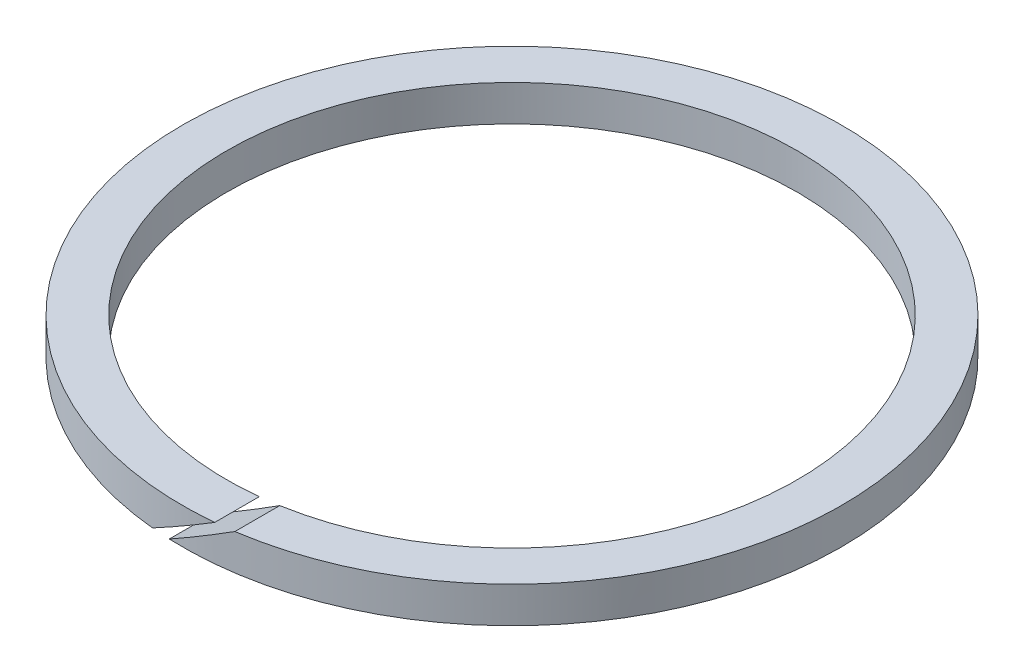
ISO-10303-21;
HEADER;
FILE_DESCRIPTION(('STEP AP214'),'2;1');
FILE_NAME('part.step','',(''),(''),'','','');
FILE_SCHEMA(('AUTOMOTIVE_DESIGN { 1 0 10303 214 1 1 1 1 }'));
ENDSEC;
DATA;
#1=APPLICATION_CONTEXT('core data for automotive mechanical design processes');
#2=APPLICATION_PROTOCOL_DEFINITION('international standard','automotive_design',2000,#1);
#3=PRODUCT_CONTEXT('',#1,'mechanical');
#4=PRODUCT('Part','Part','',(#3));
#5=PRODUCT_RELATED_PRODUCT_CATEGORY('part','',(#4));
#6=PRODUCT_DEFINITION_FORMATION('','',#4);
#7=PRODUCT_DEFINITION_CONTEXT('part definition',#1,'design');
#8=PRODUCT_DEFINITION('design','',#6,#7);
#9=PRODUCT_DEFINITION_SHAPE('','',#8);
#10=(LENGTH_UNIT() NAMED_UNIT(*) SI_UNIT(.MILLI.,.METRE.));
#11=(NAMED_UNIT(*) PLANE_ANGLE_UNIT() SI_UNIT($,.RADIAN.));
#12=(NAMED_UNIT(*) SI_UNIT($,.STERADIAN.) SOLID_ANGLE_UNIT());
#13=UNCERTAINTY_MEASURE_WITH_UNIT(LENGTH_MEASURE(1.E-05),#10,'distance_accuracy_value','');
#14=(GEOMETRIC_REPRESENTATION_CONTEXT(3) GLOBAL_UNCERTAINTY_ASSIGNED_CONTEXT((#13)) GLOBAL_UNIT_ASSIGNED_CONTEXT((#10,
#11,#12)) REPRESENTATION_CONTEXT('',''));
#15=CARTESIAN_POINT('',(0.,0.,0.));
#16=DIRECTION('',(0.,0.,1.));
#17=DIRECTION('',(1.,0.,0.));
#18=AXIS2_PLACEMENT_3D('',#15,#16,#17);
#19=CARTESIAN_POINT('',(0.,3.,0.));
#20=DIRECTION('',(0.,1.,0.));
#21=DIRECTION('',(0.,0.,1.));
#22=AXIS2_PLACEMENT_3D('',#19,#20,#21);
#23=PLANE('',#22);
#24=DIRECTION('',(0.,0.,1.));
#25=VECTOR('',#24,1.);
#26=CARTESIAN_POINT('',(2.56838924022325,3.,-27.501));
#27=LINE('',#26,#25);
#28=CARTESIAN_POINT('',(2.56838924022325,3.,23.6610096299948));
#29=VERTEX_POINT('',#28);
#30=CARTESIAN_POINT('',(2.56838924022325,3.,27.3797986974102));
#31=VERTEX_POINT('',#30);
#32=EDGE_CURVE('E84',#29,#31,#27,.T.);
#33=ORIENTED_EDGE('',*,*,#32,.F.);
#34=CARTESIAN_POINT('',(0.,3.,0.));
#35=DIRECTION('',(0.,1.,0.));
#36=DIRECTION('',(0.,0.,1.));
#37=AXIS2_PLACEMENT_3D('',#34,#35,#36);
#38=CIRCLE('',#37,23.8);
#39=CARTESIAN_POINT('',(4.06838924022325,3.,23.4496952856543));
#40=VERTEX_POINT('',#39);
#41=EDGE_CURVE('E94',#40,#29,#38,.T.);
#42=ORIENTED_EDGE('',*,*,#41,.F.);
#43=DIRECTION('',(0.,0.,1.));
#44=VECTOR('',#43,1.);
#45=CARTESIAN_POINT('',(4.06838924022325,3.,-27.501));
#46=LINE('',#45,#44);
#47=CARTESIAN_POINT('',(4.06838924022325,3.,27.1973934227167));
#48=VERTEX_POINT('',#47);
#49=EDGE_CURVE('E59',#40,#48,#46,.T.);
#50=ORIENTED_EDGE('',*,*,#49,.T.);
#51=CARTESIAN_POINT('',(0.,3.,0.));
#52=DIRECTION('',(0.,1.,0.));
#53=DIRECTION('',(0.,0.,1.));
#54=AXIS2_PLACEMENT_3D('',#51,#52,#53);
#55=CIRCLE('',#54,27.5);
#56=EDGE_CURVE('E11',#48,#31,#55,.T.);
#57=ORIENTED_EDGE('',*,*,#56,.T.);
#58=EDGE_LOOP('',(#33,#42,#50,#57));
#59=FACE_BOUND('',#58,.T.);
#60=ADVANCED_FACE('F36',(#59),#23,.T.);
#61=CARTESIAN_POINT('',(0.,0.,0.));
#62=DIRECTION('',(0.,1.,0.));
#63=DIRECTION('',(0.,0.,1.));
#64=AXIS2_PLACEMENT_3D('',#61,#62,#63);
#65=PLANE('',#64);
#66=CARTESIAN_POINT('',(0.,0.,0.));
#67=DIRECTION('',(0.,1.,0.));
#68=DIRECTION('',(0.,0.,1.));
#69=AXIS2_PLACEMENT_3D('',#66,#67,#68);
#70=CIRCLE('',#69,23.8);
#71=CARTESIAN_POINT('',(-1.12776318248345,0.,23.773265451011));
#72=VERTEX_POINT('',#71);
#73=CARTESIAN_POINT('',(-2.62776318248345,0.,23.6544892284062));
#74=VERTEX_POINT('',#73);
#75=EDGE_CURVE('E89',#72,#74,#70,.T.);
#76=ORIENTED_EDGE('',*,*,#75,.T.);
#77=DIRECTION('',(0.,0.,1.));
#78=VECTOR('',#77,1.);
#79=CARTESIAN_POINT('',(-2.62776318248345,0.,-27.501));
#80=LINE('',#79,#78);
#81=CARTESIAN_POINT('',(-2.62776318248345,0.,27.3741641088232));
#82=VERTEX_POINT('',#81);
#83=EDGE_CURVE('E51',#74,#82,#80,.T.);
#84=ORIENTED_EDGE('',*,*,#83,.T.);
#85=CARTESIAN_POINT('',(0.,0.,0.));
#86=DIRECTION('',(0.,1.,0.));
#87=DIRECTION('',(0.,0.,1.));
#88=AXIS2_PLACEMENT_3D('',#85,#86,#87);
#89=CIRCLE('',#88,27.5);
#90=CARTESIAN_POINT('',(-1.12776318248345,0.,27.4768657274485));
#91=VERTEX_POINT('',#90);
#92=EDGE_CURVE('E40',#91,#82,#89,.T.);
#93=ORIENTED_EDGE('',*,*,#92,.F.);
#94=DIRECTION('',(0.,0.,1.));
#95=VECTOR('',#94,1.);
#96=CARTESIAN_POINT('',(-1.12776318248345,0.,-27.501));
#97=LINE('',#96,#95);
#98=EDGE_CURVE('E78',#72,#91,#97,.T.);
#99=ORIENTED_EDGE('',*,*,#98,.F.);
#100=EDGE_LOOP('',(#76,#84,#93,#99));
#101=FACE_BOUND('',#100,.T.);
#102=ADVANCED_FACE('F88',(#101),#65,.F.);
#103=CARTESIAN_POINT('',(0.,3.,0.));
#104=DIRECTION('',(0.,-1.,0.));
#105=DIRECTION('',(0.,0.,-1.));
#106=AXIS2_PLACEMENT_3D('',#103,#104,#105);
#107=CYLINDRICAL_SURFACE('',#106,27.5);
#108=ORIENTED_EDGE('',*,*,#92,.T.);
#109=CARTESIAN_POINT('',(0.,1.51713978077339,0.));
#110=DIRECTION('',(-0.499999999999995,0.866025403784442,0.));
#111=DIRECTION('',(-0.866025403784441,-0.499999999999995,0.));
#112=AXIS2_PLACEMENT_3D('',#109,#110,#111);
#113=ELLIPSE('',#112,31.7542648054293,27.5);
#114=EDGE_CURVE('E95',#82,#31,#113,.T.);
#115=ORIENTED_EDGE('',*,*,#114,.T.);
#116=ORIENTED_EDGE('',*,*,#56,.F.);
#117=CARTESIAN_POINT('',(0.,0.651114376988961,0.));
#118=DIRECTION('',(0.499999999999995,-0.866025403784442,0.));
#119=DIRECTION('',(-0.866025403784442,-0.499999999999995,0.));
#120=AXIS2_PLACEMENT_3D('',#117,#118,#119);
#121=ELLIPSE('',#120,31.7542648054293,27.5);
#122=EDGE_CURVE('E98',#48,#91,#121,.T.);
#123=ORIENTED_EDGE('',*,*,#122,.T.);
#124=EDGE_LOOP('',(#108,#115,#116,#123));
#125=FACE_BOUND('',#124,.T.);
#126=ADVANCED_FACE('F38',(#125),#107,.T.);
#127=CARTESIAN_POINT('',(0.,3.,0.));
#128=DIRECTION('',(0.,-1.,0.));
#129=DIRECTION('',(0.,0.,-1.));
#130=AXIS2_PLACEMENT_3D('',#127,#128,#129);
#131=CYLINDRICAL_SURFACE('',#130,23.8);
#132=CARTESIAN_POINT('',(0.,1.51713978077339,0.));
#133=DIRECTION('',(-0.499999999999995,0.866025403784442,0.));
#134=DIRECTION('',(-0.866025403784441,-0.499999999999995,0.));
#135=AXIS2_PLACEMENT_3D('',#132,#133,#134);
#136=ELLIPSE('',#135,27.4818728134261,23.8);
#137=EDGE_CURVE('E91',#29,#74,#136,.F.);
#138=ORIENTED_EDGE('',*,*,#137,.T.);
#139=ORIENTED_EDGE('',*,*,#75,.F.);
#140=CARTESIAN_POINT('',(0.,0.651114376988961,0.));
#141=DIRECTION('',(0.499999999999995,-0.866025403784442,0.));
#142=DIRECTION('',(-0.866025403784442,-0.499999999999995,0.));
#143=AXIS2_PLACEMENT_3D('',#140,#141,#142);
#144=ELLIPSE('',#143,27.4818728134261,23.8);
#145=EDGE_CURVE('E75',#72,#40,#144,.F.);
#146=ORIENTED_EDGE('',*,*,#145,.T.);
#147=ORIENTED_EDGE('',*,*,#41,.T.);
#148=EDGE_LOOP('',(#138,#139,#146,#147));
#149=FACE_BOUND('',#148,.T.);
#150=ADVANCED_FACE('F93',(#149),#131,.F.);
#151=CARTESIAN_POINT('',(4.06838924022325,3.,-27.501));
#152=DIRECTION('',(0.499999999999995,-0.866025403784442,0.));
#153=DIRECTION('',(0.866025403784442,0.499999999999995,0.));
#154=AXIS2_PLACEMENT_3D('',#151,#152,#153);
#155=PLANE('',#154);
#156=ORIENTED_EDGE('',*,*,#49,.F.);
#157=ORIENTED_EDGE('',*,*,#145,.F.);
#158=ORIENTED_EDGE('',*,*,#98,.T.);
#159=ORIENTED_EDGE('',*,*,#122,.F.);
#160=EDGE_LOOP('',(#156,#157,#158,#159));
#161=FACE_BOUND('',#160,.T.);
#162=ADVANCED_FACE('F77',(#161),#155,.F.);
#163=CARTESIAN_POINT('',(-2.62776318248345,0.,-27.501));
#164=DIRECTION('',(-0.499999999999995,0.866025403784442,0.));
#165=DIRECTION('',(-0.866025403784441,-0.499999999999995,0.));
#166=AXIS2_PLACEMENT_3D('',#163,#164,#165);
#167=PLANE('',#166);
#168=ORIENTED_EDGE('',*,*,#83,.F.);
#169=ORIENTED_EDGE('',*,*,#137,.F.);
#170=ORIENTED_EDGE('',*,*,#32,.T.);
#171=ORIENTED_EDGE('',*,*,#114,.F.);
#172=EDGE_LOOP('',(#168,#169,#170,#171));
#173=FACE_BOUND('',#172,.T.);
#174=ADVANCED_FACE('F110',(#173),#167,.F.);
#175=CLOSED_SHELL('',(#60,#102,#126,#150,#162,#174));
#176=MANIFOLD_SOLID_BREP('B2',#175);
#177=ADVANCED_BREP_SHAPE_REPRESENTATION('',(#18,#176),#14);
#178=SHAPE_DEFINITION_REPRESENTATION(#9,#177);
ENDSEC;
END-ISO-10303-21;
